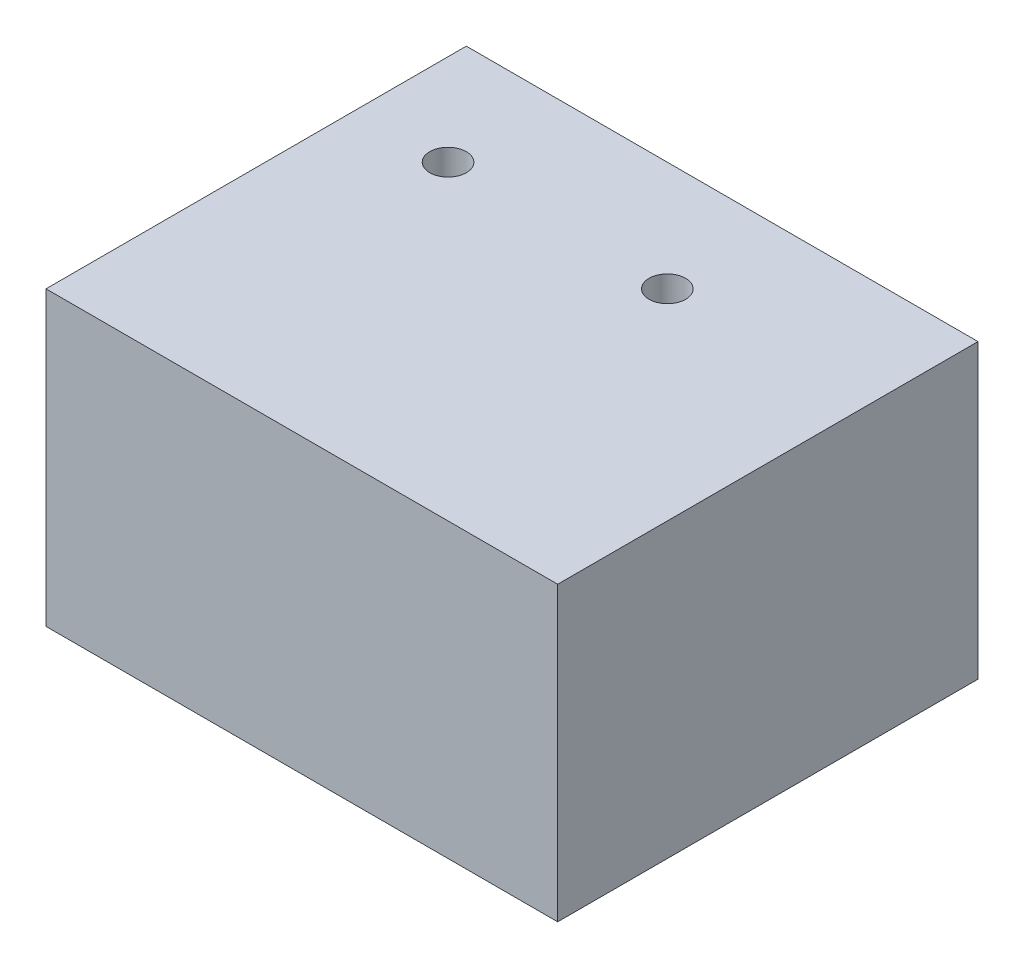
ISO-10303-21;
HEADER;
FILE_DESCRIPTION(('STEP AP214'),'2;1');
FILE_NAME('part.step','',(''),(''),'','','');
FILE_SCHEMA(('AUTOMOTIVE_DESIGN { 1 0 10303 214 1 1 1 1 }'));
ENDSEC;
DATA;
#1=APPLICATION_CONTEXT('core data for automotive mechanical design processes');
#2=APPLICATION_PROTOCOL_DEFINITION('international standard','automotive_design',2000,#1);
#3=PRODUCT_CONTEXT('',#1,'mechanical');
#4=PRODUCT('Part','Part','',(#3));
#5=PRODUCT_RELATED_PRODUCT_CATEGORY('part','',(#4));
#6=PRODUCT_DEFINITION_FORMATION('','',#4);
#7=PRODUCT_DEFINITION_CONTEXT('part definition',#1,'design');
#8=PRODUCT_DEFINITION('design','',#6,#7);
#9=PRODUCT_DEFINITION_SHAPE('','',#8);
#10=(LENGTH_UNIT() NAMED_UNIT(*) SI_UNIT(.MILLI.,.METRE.));
#11=(NAMED_UNIT(*) PLANE_ANGLE_UNIT() SI_UNIT($,.RADIAN.));
#12=(NAMED_UNIT(*) SI_UNIT($,.STERADIAN.) SOLID_ANGLE_UNIT());
#13=UNCERTAINTY_MEASURE_WITH_UNIT(LENGTH_MEASURE(1.E-05),#10,'distance_accuracy_value','');
#14=(GEOMETRIC_REPRESENTATION_CONTEXT(3) GLOBAL_UNCERTAINTY_ASSIGNED_CONTEXT((#13)) GLOBAL_UNIT_ASSIGNED_CONTEXT((#10,
#11,#12)) REPRESENTATION_CONTEXT('',''));
#15=CARTESIAN_POINT('',(0.,0.,0.));
#16=DIRECTION('',(0.,0.,1.));
#17=DIRECTION('',(1.,0.,0.));
#18=AXIS2_PLACEMENT_3D('',#15,#16,#17);
#19=CARTESIAN_POINT('',(-46.0947866391038,80.,23.953186070102));
#20=DIRECTION('',(1.,0.,0.));
#21=DIRECTION('',(0.,0.,-1.));
#22=AXIS2_PLACEMENT_3D('',#19,#20,#21);
#23=PLANE('',#22);
#24=CARTESIAN_POINT('',(-46.0947866391038,15.,-51.046813929898));
#25=DIRECTION('',(-1.,0.,0.));
#26=DIRECTION('',(0.,0.,1.));
#27=AXIS2_PLACEMENT_3D('',#24,#25,#26);
#28=CIRCLE('',#27,4.99999999999999);
#29=CARTESIAN_POINT('',(-46.0947866391038,15.,-46.046813929898));
#30=VERTEX_POINT('',#29);
#31=EDGE_CURVE('E184',#30,#30,#28,.T.);
#32=ORIENTED_EDGE('',*,*,#31,.F.);
#33=EDGE_LOOP('',(#32));
#34=FACE_BOUND('',#33,.T.);
#35=DIRECTION('',(0.,0.,1.));
#36=VECTOR('',#35,1.);
#37=CARTESIAN_POINT('',(-46.0947866391038,0.,23.953186070102));
#38=LINE('',#37,#36);
#39=CARTESIAN_POINT('',(-46.0947866391038,0.,-91.046813929898));
#40=VERTEX_POINT('',#39);
#41=CARTESIAN_POINT('',(-46.0947866391038,0.,23.953186070102));
#42=VERTEX_POINT('',#41);
#43=EDGE_CURVE('E147',#40,#42,#38,.T.);
#44=ORIENTED_EDGE('',*,*,#43,.T.);
#45=DIRECTION('',(0.,-1.,0.));
#46=VECTOR('',#45,1.);
#47=CARTESIAN_POINT('',(-46.0947866391038,80.,23.953186070102));
#48=LINE('',#47,#46);
#49=CARTESIAN_POINT('',(-46.0947866391038,80.,23.953186070102));
#50=VERTEX_POINT('',#49);
#51=EDGE_CURVE('E11',#50,#42,#48,.T.);
#52=ORIENTED_EDGE('',*,*,#51,.F.);
#53=DIRECTION('',(0.,0.,1.));
#54=VECTOR('',#53,1.);
#55=CARTESIAN_POINT('',(-46.0947866391038,80.,23.953186070102));
#56=LINE('',#55,#54);
#57=CARTESIAN_POINT('',(-46.0947866391038,80.,-91.046813929898));
#58=VERTEX_POINT('',#57);
#59=EDGE_CURVE('E151',#58,#50,#56,.T.);
#60=ORIENTED_EDGE('',*,*,#59,.F.);
#61=DIRECTION('',(0.,-1.,0.));
#62=VECTOR('',#61,1.);
#63=CARTESIAN_POINT('',(-46.0947866391038,80.,-91.046813929898));
#64=LINE('',#63,#62);
#65=EDGE_CURVE('E157',#58,#40,#64,.T.);
#66=ORIENTED_EDGE('',*,*,#65,.T.);
#67=EDGE_LOOP('',(#44,#52,#60,#66));
#68=FACE_BOUND('',#67,.T.);
#69=ADVANCED_FACE('F33',(#34,#68),#23,.F.);
#70=CARTESIAN_POINT('',(-46.0947866391038,80.,23.953186070102));
#71=DIRECTION('',(0.,0.,-1.));
#72=DIRECTION('',(-1.,0.,0.));
#73=AXIS2_PLACEMENT_3D('',#70,#71,#72);
#74=PLANE('',#73);
#75=DIRECTION('',(1.,0.,0.));
#76=VECTOR('',#75,1.);
#77=CARTESIAN_POINT('',(-46.0947866391038,0.,23.953186070102));
#78=LINE('',#77,#76);
#79=CARTESIAN_POINT('',(93.9052133608962,0.,23.953186070102));
#80=VERTEX_POINT('',#79);
#81=EDGE_CURVE('E160',#42,#80,#78,.T.);
#82=ORIENTED_EDGE('',*,*,#81,.T.);
#83=DIRECTION('',(0.,-1.,0.));
#84=VECTOR('',#83,1.);
#85=CARTESIAN_POINT('',(93.9052133608962,80.,23.953186070102));
#86=LINE('',#85,#84);
#87=CARTESIAN_POINT('',(93.9052133608962,80.,23.953186070102));
#88=VERTEX_POINT('',#87);
#89=EDGE_CURVE('E41',#88,#80,#86,.T.);
#90=ORIENTED_EDGE('',*,*,#89,.F.);
#91=DIRECTION('',(1.,0.,0.));
#92=VECTOR('',#91,1.);
#93=CARTESIAN_POINT('',(-46.0947866391038,80.,23.953186070102));
#94=LINE('',#93,#92);
#95=EDGE_CURVE('E86',#50,#88,#94,.T.);
#96=ORIENTED_EDGE('',*,*,#95,.F.);
#97=ORIENTED_EDGE('',*,*,#51,.T.);
#98=EDGE_LOOP('',(#82,#90,#96,#97));
#99=FACE_BOUND('',#98,.T.);
#100=ADVANCED_FACE('F195',(#99),#74,.F.);
#101=CARTESIAN_POINT('',(93.9052133608962,80.,23.953186070102));
#102=DIRECTION('',(-1.,0.,0.));
#103=DIRECTION('',(0.,0.,1.));
#104=AXIS2_PLACEMENT_3D('',#101,#102,#103);
#105=PLANE('',#104);
#106=DIRECTION('',(0.,0.,-1.));
#107=VECTOR('',#106,1.);
#108=CARTESIAN_POINT('',(93.9052133608962,0.,23.953186070102));
#109=LINE('',#108,#107);
#110=CARTESIAN_POINT('',(93.9052133608962,0.,-91.046813929898));
#111=VERTEX_POINT('',#110);
#112=EDGE_CURVE('E162',#80,#111,#109,.T.);
#113=ORIENTED_EDGE('',*,*,#112,.T.);
#114=DIRECTION('',(0.,-1.,0.));
#115=VECTOR('',#114,1.);
#116=CARTESIAN_POINT('',(93.9052133608962,80.,-91.046813929898));
#117=LINE('',#116,#115);
#118=CARTESIAN_POINT('',(93.9052133608962,80.,-91.046813929898));
#119=VERTEX_POINT('',#118);
#120=EDGE_CURVE('E166',#119,#111,#117,.T.);
#121=ORIENTED_EDGE('',*,*,#120,.F.);
#122=DIRECTION('',(0.,0.,-1.));
#123=VECTOR('',#122,1.);
#124=CARTESIAN_POINT('',(93.9052133608962,80.,23.953186070102));
#125=LINE('',#124,#123);
#126=EDGE_CURVE('E154',#88,#119,#125,.T.);
#127=ORIENTED_EDGE('',*,*,#126,.F.);
#128=ORIENTED_EDGE('',*,*,#89,.T.);
#129=EDGE_LOOP('',(#113,#121,#127,#128));
#130=FACE_BOUND('',#129,.T.);
#131=ADVANCED_FACE('F203',(#130),#105,.F.);
#132=CARTESIAN_POINT('',(-46.0947866391038,80.,-91.046813929898));
#133=DIRECTION('',(0.,0.,1.));
#134=DIRECTION('',(1.,0.,0.));
#135=AXIS2_PLACEMENT_3D('',#132,#133,#134);
#136=PLANE('',#135);
#137=DIRECTION('',(-1.,0.,0.));
#138=VECTOR('',#137,1.);
#139=CARTESIAN_POINT('',(86.9052133608962,7.00000000000001,-91.046813929898));
#140=LINE('',#139,#138);
#141=CARTESIAN_POINT('',(86.9052133608962,7.00000000000001,-91.046813929898));
#142=VERTEX_POINT('',#141);
#143=CARTESIAN_POINT('',(-39.0947866391038,7.00000000000001,-91.046813929898));
#144=VERTEX_POINT('',#143);
#145=EDGE_CURVE('E140',#142,#144,#140,.T.);
#146=ORIENTED_EDGE('',*,*,#145,.F.);
#147=DIRECTION('',(0.,-1.,0.));
#148=VECTOR('',#147,1.);
#149=CARTESIAN_POINT('',(86.9052133608962,7.00000000000001,-91.046813929898));
#150=LINE('',#149,#148);
#151=CARTESIAN_POINT('',(86.9052133608962,73.,-91.046813929898));
#152=VERTEX_POINT('',#151);
#153=EDGE_CURVE('E49',#152,#142,#150,.T.);
#154=ORIENTED_EDGE('',*,*,#153,.F.);
#155=DIRECTION('',(1.,0.,0.));
#156=VECTOR('',#155,1.);
#157=CARTESIAN_POINT('',(86.9052133608962,73.,-91.046813929898));
#158=LINE('',#157,#156);
#159=CARTESIAN_POINT('',(-39.0947866391038,73.,-91.046813929898));
#160=VERTEX_POINT('',#159);
#161=EDGE_CURVE('E128',#160,#152,#158,.T.);
#162=ORIENTED_EDGE('',*,*,#161,.F.);
#163=DIRECTION('',(0.,1.,0.));
#164=VECTOR('',#163,1.);
#165=CARTESIAN_POINT('',(-39.0947866391038,7.00000000000001,-91.046813929898));
#166=LINE('',#165,#164);
#167=EDGE_CURVE('E131',#144,#160,#166,.T.);
#168=ORIENTED_EDGE('',*,*,#167,.F.);
#169=EDGE_LOOP('',(#146,#154,#162,#168));
#170=FACE_BOUND('',#169,.T.);
#171=DIRECTION('',(-1.,0.,0.));
#172=VECTOR('',#171,1.);
#173=CARTESIAN_POINT('',(-46.0947866391038,0.,-91.046813929898));
#174=LINE('',#173,#172);
#175=EDGE_CURVE('E79',#111,#40,#174,.T.);
#176=ORIENTED_EDGE('',*,*,#175,.T.);
#177=ORIENTED_EDGE('',*,*,#65,.F.);
#178=DIRECTION('',(-1.,0.,0.));
#179=VECTOR('',#178,1.);
#180=CARTESIAN_POINT('',(-46.0947866391038,80.,-91.046813929898));
#181=LINE('',#180,#179);
#182=EDGE_CURVE('E58',#119,#58,#181,.T.);
#183=ORIENTED_EDGE('',*,*,#182,.F.);
#184=ORIENTED_EDGE('',*,*,#120,.T.);
#185=EDGE_LOOP('',(#176,#177,#183,#184));
#186=FACE_BOUND('',#185,.T.);
#187=ADVANCED_FACE('F207',(#170,#186),#136,.F.);
#188=CARTESIAN_POINT('',(0.,80.,0.));
#189=DIRECTION('',(0.,-1.,0.));
#190=DIRECTION('',(0.,0.,-1.));
#191=AXIS2_PLACEMENT_3D('',#188,#189,#190);
#192=PLANE('',#191);
#193=CARTESIAN_POINT('',(-21.0947866391038,80.,-61.046813929898));
#194=DIRECTION('',(0.,1.,0.));
#195=DIRECTION('',(0.,0.,1.));
#196=AXIS2_PLACEMENT_3D('',#193,#194,#195);
#197=CIRCLE('',#196,4.99999999999999);
#198=CARTESIAN_POINT('',(-21.0947866391038,80.,-56.046813929898));
#199=VERTEX_POINT('',#198);
#200=EDGE_CURVE('E176',#199,#199,#197,.T.);
#201=ORIENTED_EDGE('',*,*,#200,.F.);
#202=EDGE_LOOP('',(#201));
#203=FACE_BOUND('',#202,.T.);
#204=CARTESIAN_POINT('',(38.9052133608962,80.,-61.046813929898));
#205=DIRECTION('',(0.,1.,0.));
#206=DIRECTION('',(0.,0.,1.));
#207=AXIS2_PLACEMENT_3D('',#204,#205,#206);
#208=CIRCLE('',#207,5.);
#209=CARTESIAN_POINT('',(38.9052133608962,80.,-56.046813929898));
#210=VERTEX_POINT('',#209);
#211=EDGE_CURVE('E134',#210,#210,#208,.T.);
#212=ORIENTED_EDGE('',*,*,#211,.F.);
#213=EDGE_LOOP('',(#212));
#214=FACE_BOUND('',#213,.T.);
#215=ORIENTED_EDGE('',*,*,#59,.T.);
#216=ORIENTED_EDGE('',*,*,#95,.T.);
#217=ORIENTED_EDGE('',*,*,#126,.T.);
#218=ORIENTED_EDGE('',*,*,#182,.T.);
#219=EDGE_LOOP('',(#215,#216,#217,#218));
#220=FACE_BOUND('',#219,.T.);
#221=ADVANCED_FACE('F213',(#203,#214,#220),#192,.F.);
#222=CARTESIAN_POINT('',(0.,0.,0.));
#223=DIRECTION('',(0.,-1.,0.));
#224=DIRECTION('',(0.,0.,-1.));
#225=AXIS2_PLACEMENT_3D('',#222,#223,#224);
#226=PLANE('',#225);
#227=ORIENTED_EDGE('',*,*,#43,.F.);
#228=ORIENTED_EDGE('',*,*,#175,.F.);
#229=ORIENTED_EDGE('',*,*,#112,.F.);
#230=ORIENTED_EDGE('',*,*,#81,.F.);
#231=EDGE_LOOP('',(#227,#228,#229,#230));
#232=FACE_BOUND('',#231,.T.);
#233=ADVANCED_FACE('F200',(#232),#226,.T.);
#234=CARTESIAN_POINT('',(86.9052133608962,7.00000000000001,16.953186070102));
#235=DIRECTION('',(1.,0.,0.));
#236=DIRECTION('',(0.,0.,-1.));
#237=AXIS2_PLACEMENT_3D('',#234,#235,#236);
#238=PLANE('',#237);
#239=ORIENTED_EDGE('',*,*,#153,.T.);
#240=DIRECTION('',(0.,0.,-1.));
#241=VECTOR('',#240,1.);
#242=CARTESIAN_POINT('',(86.9052133608962,7.00000000000001,16.953186070102));
#243=LINE('',#242,#241);
#244=CARTESIAN_POINT('',(86.9052133608962,7.00000000000001,16.953186070102));
#245=VERTEX_POINT('',#244);
#246=EDGE_CURVE('E106',#245,#142,#243,.T.);
#247=ORIENTED_EDGE('',*,*,#246,.F.);
#248=DIRECTION('',(0.,-1.,0.));
#249=VECTOR('',#248,1.);
#250=CARTESIAN_POINT('',(86.9052133608962,7.00000000000001,16.953186070102));
#251=LINE('',#250,#249);
#252=CARTESIAN_POINT('',(86.9052133608962,73.,16.953186070102));
#253=VERTEX_POINT('',#252);
#254=EDGE_CURVE('E110',#253,#245,#251,.T.);
#255=ORIENTED_EDGE('',*,*,#254,.F.);
#256=DIRECTION('',(0.,0.,-1.));
#257=VECTOR('',#256,1.);
#258=CARTESIAN_POINT('',(86.9052133608962,73.,16.953186070102));
#259=LINE('',#258,#257);
#260=EDGE_CURVE('E145',#253,#152,#259,.T.);
#261=ORIENTED_EDGE('',*,*,#260,.T.);
#262=EDGE_LOOP('',(#239,#247,#255,#261));
#263=FACE_BOUND('',#262,.T.);
#264=ADVANCED_FACE('F108',(#263),#238,.F.);
#265=CARTESIAN_POINT('',(86.9052133608962,73.,16.953186070102));
#266=DIRECTION('',(0.,1.,0.));
#267=DIRECTION('',(0.,0.,1.));
#268=AXIS2_PLACEMENT_3D('',#265,#266,#267);
#269=PLANE('',#268);
#270=CARTESIAN_POINT('',(-21.0947866391038,73.,-61.046813929898));
#271=DIRECTION('',(0.,1.,0.));
#272=DIRECTION('',(0.,0.,1.));
#273=AXIS2_PLACEMENT_3D('',#270,#271,#272);
#274=CIRCLE('',#273,4.99999999999999);
#275=CARTESIAN_POINT('',(-21.0947866391038,73.,-56.046813929898));
#276=VERTEX_POINT('',#275);
#277=EDGE_CURVE('E36',#276,#276,#274,.T.);
#278=ORIENTED_EDGE('',*,*,#277,.T.);
#279=EDGE_LOOP('',(#278));
#280=FACE_BOUND('',#279,.T.);
#281=CARTESIAN_POINT('',(38.9052133608962,73.,-61.046813929898));
#282=DIRECTION('',(0.,1.,0.));
#283=DIRECTION('',(0.,0.,1.));
#284=AXIS2_PLACEMENT_3D('',#281,#282,#283);
#285=CIRCLE('',#284,4.99999999999999);
#286=CARTESIAN_POINT('',(38.9052133608962,73.,-56.046813929898));
#287=VERTEX_POINT('',#286);
#288=EDGE_CURVE('E141',#287,#287,#285,.T.);
#289=ORIENTED_EDGE('',*,*,#288,.T.);
#290=EDGE_LOOP('',(#289));
#291=FACE_BOUND('',#290,.T.);
#292=ORIENTED_EDGE('',*,*,#161,.T.);
#293=ORIENTED_EDGE('',*,*,#260,.F.);
#294=DIRECTION('',(1.,0.,0.));
#295=VECTOR('',#294,1.);
#296=CARTESIAN_POINT('',(86.9052133608962,73.,16.953186070102));
#297=LINE('',#296,#295);
#298=CARTESIAN_POINT('',(-39.0947866391038,73.,16.953186070102));
#299=VERTEX_POINT('',#298);
#300=EDGE_CURVE('E116',#299,#253,#297,.T.);
#301=ORIENTED_EDGE('',*,*,#300,.F.);
#302=DIRECTION('',(0.,0.,-1.));
#303=VECTOR('',#302,1.);
#304=CARTESIAN_POINT('',(-39.0947866391038,73.,16.953186070102));
#305=LINE('',#304,#303);
#306=EDGE_CURVE('E148',#299,#160,#305,.T.);
#307=ORIENTED_EDGE('',*,*,#306,.T.);
#308=EDGE_LOOP('',(#292,#293,#301,#307));
#309=FACE_BOUND('',#308,.T.);
#310=ADVANCED_FACE('F222',(#280,#291,#309),#269,.F.);
#311=CARTESIAN_POINT('',(-39.0947866391038,7.00000000000001,16.953186070102));
#312=DIRECTION('',(-1.,0.,0.));
#313=DIRECTION('',(0.,-1.,0.));
#314=AXIS2_PLACEMENT_3D('',#311,#312,#313);
#315=PLANE('',#314);
#316=CARTESIAN_POINT('',(-39.0947866391038,15.,-51.046813929898));
#317=DIRECTION('',(-1.,0.,0.));
#318=DIRECTION('',(0.,-1.,0.));
#319=AXIS2_PLACEMENT_3D('',#316,#317,#318);
#320=CIRCLE('',#319,4.99999999999999);
#321=CARTESIAN_POINT('',(-39.0947866391038,10.,-51.046813929898));
#322=VERTEX_POINT('',#321);
#323=EDGE_CURVE('E180',#322,#322,#320,.T.);
#324=ORIENTED_EDGE('',*,*,#323,.T.);
#325=EDGE_LOOP('',(#324));
#326=FACE_BOUND('',#325,.T.);
#327=ORIENTED_EDGE('',*,*,#167,.T.);
#328=ORIENTED_EDGE('',*,*,#306,.F.);
#329=DIRECTION('',(0.,1.,0.));
#330=VECTOR('',#329,1.);
#331=CARTESIAN_POINT('',(-39.0947866391038,7.00000000000001,16.953186070102));
#332=LINE('',#331,#330);
#333=CARTESIAN_POINT('',(-39.0947866391038,7.00000000000001,16.953186070102));
#334=VERTEX_POINT('',#333);
#335=EDGE_CURVE('E124',#334,#299,#332,.T.);
#336=ORIENTED_EDGE('',*,*,#335,.F.);
#337=DIRECTION('',(0.,0.,-1.));
#338=VECTOR('',#337,1.);
#339=CARTESIAN_POINT('',(-39.0947866391038,7.00000000000001,16.953186070102));
#340=LINE('',#339,#338);
#341=EDGE_CURVE('E115',#334,#144,#340,.T.);
#342=ORIENTED_EDGE('',*,*,#341,.T.);
#343=EDGE_LOOP('',(#327,#328,#336,#342));
#344=FACE_BOUND('',#343,.T.);
#345=ADVANCED_FACE('F225',(#326,#344),#315,.F.);
#346=CARTESIAN_POINT('',(86.9052133608962,7.00000000000001,16.953186070102));
#347=DIRECTION('',(0.,-1.,0.));
#348=DIRECTION('',(0.,0.,-1.));
#349=AXIS2_PLACEMENT_3D('',#346,#347,#348);
#350=PLANE('',#349);
#351=ORIENTED_EDGE('',*,*,#145,.T.);
#352=ORIENTED_EDGE('',*,*,#341,.F.);
#353=DIRECTION('',(-1.,0.,0.));
#354=VECTOR('',#353,1.);
#355=CARTESIAN_POINT('',(86.9052133608962,7.00000000000001,16.953186070102));
#356=LINE('',#355,#354);
#357=EDGE_CURVE('E119',#245,#334,#356,.T.);
#358=ORIENTED_EDGE('',*,*,#357,.F.);
#359=ORIENTED_EDGE('',*,*,#246,.T.);
#360=EDGE_LOOP('',(#351,#352,#358,#359));
#361=FACE_BOUND('',#360,.T.);
#362=ADVANCED_FACE('F120',(#361),#350,.F.);
#363=CARTESIAN_POINT('',(0.,0.,16.953186070102));
#364=DIRECTION('',(0.,0.,1.));
#365=DIRECTION('',(1.,0.,0.));
#366=AXIS2_PLACEMENT_3D('',#363,#364,#365);
#367=PLANE('',#366);
#368=ORIENTED_EDGE('',*,*,#254,.T.);
#369=ORIENTED_EDGE('',*,*,#357,.T.);
#370=ORIENTED_EDGE('',*,*,#335,.T.);
#371=ORIENTED_EDGE('',*,*,#300,.T.);
#372=EDGE_LOOP('',(#368,#369,#370,#371));
#373=FACE_BOUND('',#372,.T.);
#374=ADVANCED_FACE('F126',(#373),#367,.F.);
#375=CARTESIAN_POINT('',(38.9052133608962,80.,-61.046813929898));
#376=DIRECTION('',(0.,1.,0.));
#377=DIRECTION('',(0.,0.,1.));
#378=AXIS2_PLACEMENT_3D('',#375,#376,#377);
#379=CYLINDRICAL_SURFACE('',#378,4.99999999999999);
#380=ORIENTED_EDGE('',*,*,#211,.T.);
#381=EDGE_LOOP('',(#380));
#382=FACE_BOUND('',#381,.T.);
#383=ORIENTED_EDGE('',*,*,#288,.F.);
#384=EDGE_LOOP('',(#383));
#385=FACE_BOUND('',#384,.T.);
#386=ADVANCED_FACE('F233',(#382,#385),#379,.F.);
#387=CARTESIAN_POINT('',(-21.0947866391038,80.,-61.046813929898));
#388=DIRECTION('',(0.,1.,0.));
#389=DIRECTION('',(0.,0.,1.));
#390=AXIS2_PLACEMENT_3D('',#387,#388,#389);
#391=CYLINDRICAL_SURFACE('',#390,4.99999999999999);
#392=ORIENTED_EDGE('',*,*,#200,.T.);
#393=EDGE_LOOP('',(#392));
#394=FACE_BOUND('',#393,.T.);
#395=ORIENTED_EDGE('',*,*,#277,.F.);
#396=EDGE_LOOP('',(#395));
#397=FACE_BOUND('',#396,.T.);
#398=ADVANCED_FACE('F236',(#394,#397),#391,.F.);
#399=CARTESIAN_POINT('',(-46.0947866391038,15.,-51.046813929898));
#400=DIRECTION('',(-1.,0.,0.));
#401=DIRECTION('',(0.,0.,1.));
#402=AXIS2_PLACEMENT_3D('',#399,#400,#401);
#403=CYLINDRICAL_SURFACE('',#402,4.99999999999999);
#404=ORIENTED_EDGE('',*,*,#31,.T.);
#405=EDGE_LOOP('',(#404));
#406=FACE_BOUND('',#405,.T.);
#407=ORIENTED_EDGE('',*,*,#323,.F.);
#408=EDGE_LOOP('',(#407));
#409=FACE_BOUND('',#408,.T.);
#410=ADVANCED_FACE('F190',(#406,#409),#403,.F.);
#411=CLOSED_SHELL('',(#69,#100,#131,#187,#221,#233,#264,#310,#345,#362,#374,#386,#398,#410));
#412=MANIFOLD_SOLID_BREP('B2',#411);
#413=ADVANCED_BREP_SHAPE_REPRESENTATION('',(#18,#412),#14);
#414=SHAPE_DEFINITION_REPRESENTATION(#9,#413);
ENDSEC;
END-ISO-10303-21;
